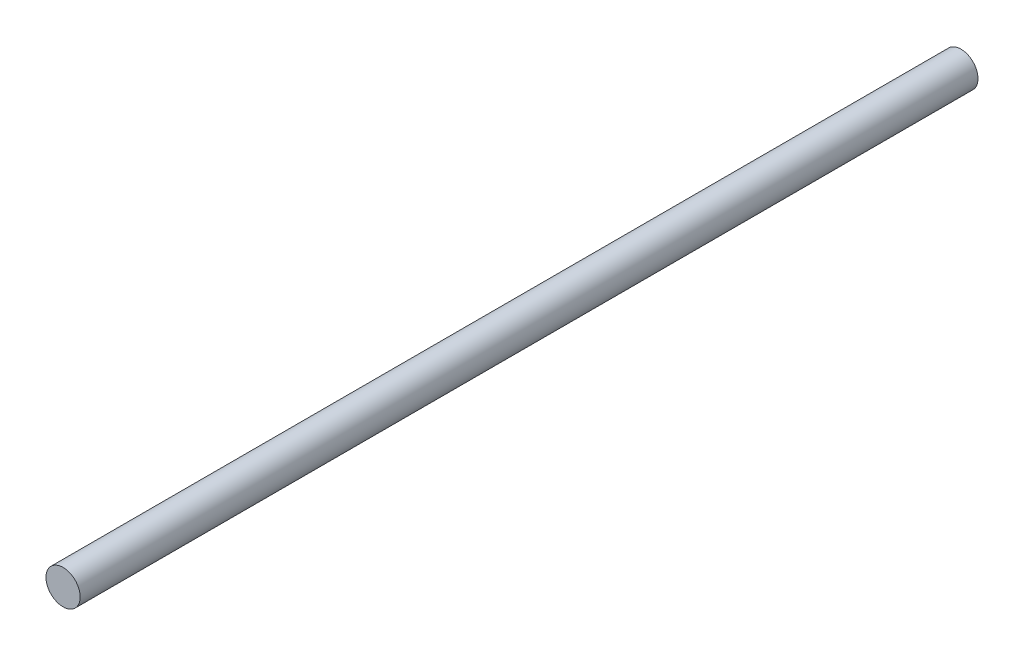
ISO-10303-21;
HEADER;
FILE_DESCRIPTION(('STEP AP214'),'2;1');
FILE_NAME('part.step','',(''),(''),'','','');
FILE_SCHEMA(('AUTOMOTIVE_DESIGN { 1 0 10303 214 1 1 1 1 }'));
ENDSEC;
DATA;
#1=APPLICATION_CONTEXT('core data for automotive mechanical design processes');
#2=APPLICATION_PROTOCOL_DEFINITION('international standard','automotive_design',2000,#1);
#3=PRODUCT_CONTEXT('',#1,'mechanical');
#4=PRODUCT('Part','Part','',(#3));
#5=PRODUCT_RELATED_PRODUCT_CATEGORY('part','',(#4));
#6=PRODUCT_DEFINITION_FORMATION('','',#4);
#7=PRODUCT_DEFINITION_CONTEXT('part definition',#1,'design');
#8=PRODUCT_DEFINITION('design','',#6,#7);
#9=PRODUCT_DEFINITION_SHAPE('','',#8);
#10=(LENGTH_UNIT() NAMED_UNIT(*) SI_UNIT(.MILLI.,.METRE.));
#11=(NAMED_UNIT(*) PLANE_ANGLE_UNIT() SI_UNIT($,.RADIAN.));
#12=(NAMED_UNIT(*) SI_UNIT($,.STERADIAN.) SOLID_ANGLE_UNIT());
#13=UNCERTAINTY_MEASURE_WITH_UNIT(LENGTH_MEASURE(1.E-05),#10,'distance_accuracy_value','');
#14=(GEOMETRIC_REPRESENTATION_CONTEXT(3) GLOBAL_UNCERTAINTY_ASSIGNED_CONTEXT((#13)) GLOBAL_UNIT_ASSIGNED_CONTEXT((#10,
#11,#12)) REPRESENTATION_CONTEXT('',''));
#15=CARTESIAN_POINT('',(0.,0.,0.));
#16=DIRECTION('',(0.,0.,1.));
#17=DIRECTION('',(1.,0.,0.));
#18=AXIS2_PLACEMENT_3D('',#15,#16,#17);
#19=CARTESIAN_POINT('',(0.,0.,210.));
#20=DIRECTION('',(0.,0.,-1.));
#21=DIRECTION('',(-1.,0.,0.));
#22=AXIS2_PLACEMENT_3D('',#19,#20,#21);
#23=CYLINDRICAL_SURFACE('',#22,4.);
#24=CARTESIAN_POINT('',(0.,0.,210.));
#25=DIRECTION('',(0.,0.,1.));
#26=DIRECTION('',(1.,0.,0.));
#27=AXIS2_PLACEMENT_3D('',#24,#25,#26);
#28=CIRCLE('',#27,4.);
#29=CARTESIAN_POINT('',(4.,0.,210.));
#30=VERTEX_POINT('',#29);
#31=EDGE_CURVE('E10',#30,#30,#28,.T.);
#32=ORIENTED_EDGE('',*,*,#31,.F.);
#33=EDGE_LOOP('',(#32));
#34=FACE_BOUND('',#33,.T.);
#35=CARTESIAN_POINT('',(0.,0.,0.));
#36=DIRECTION('',(0.,0.,1.));
#37=DIRECTION('',(1.,0.,0.));
#38=AXIS2_PLACEMENT_3D('',#35,#36,#37);
#39=CIRCLE('',#38,4.);
#40=CARTESIAN_POINT('',(4.,0.,0.));
#41=VERTEX_POINT('',#40);
#42=EDGE_CURVE('E34',#41,#41,#39,.T.);
#43=ORIENTED_EDGE('',*,*,#42,.T.);
#44=EDGE_LOOP('',(#43));
#45=FACE_BOUND('',#44,.T.);
#46=ADVANCED_FACE('F31',(#34,#45),#23,.T.);
#47=CARTESIAN_POINT('',(0.,0.,210.));
#48=DIRECTION('',(0.,0.,1.));
#49=DIRECTION('',(1.,0.,0.));
#50=AXIS2_PLACEMENT_3D('',#47,#48,#49);
#51=PLANE('',#50);
#52=ORIENTED_EDGE('',*,*,#31,.T.);
#53=EDGE_LOOP('',(#52));
#54=FACE_BOUND('',#53,.T.);
#55=ADVANCED_FACE('F46',(#54),#51,.T.);
#56=CARTESIAN_POINT('',(0.,0.,0.));
#57=DIRECTION('',(0.,0.,1.));
#58=DIRECTION('',(1.,0.,0.));
#59=AXIS2_PLACEMENT_3D('',#56,#57,#58);
#60=PLANE('',#59);
#61=ORIENTED_EDGE('',*,*,#42,.F.);
#62=EDGE_LOOP('',(#61));
#63=FACE_BOUND('',#62,.T.);
#64=ADVANCED_FACE('F44',(#63),#60,.F.);
#65=CLOSED_SHELL('',(#46,#55,#64));
#66=MANIFOLD_SOLID_BREP('B2',#65);
#67=ADVANCED_BREP_SHAPE_REPRESENTATION('',(#18,#66),#14);
#68=SHAPE_DEFINITION_REPRESENTATION(#9,#67);
ENDSEC;
END-ISO-10303-21;
